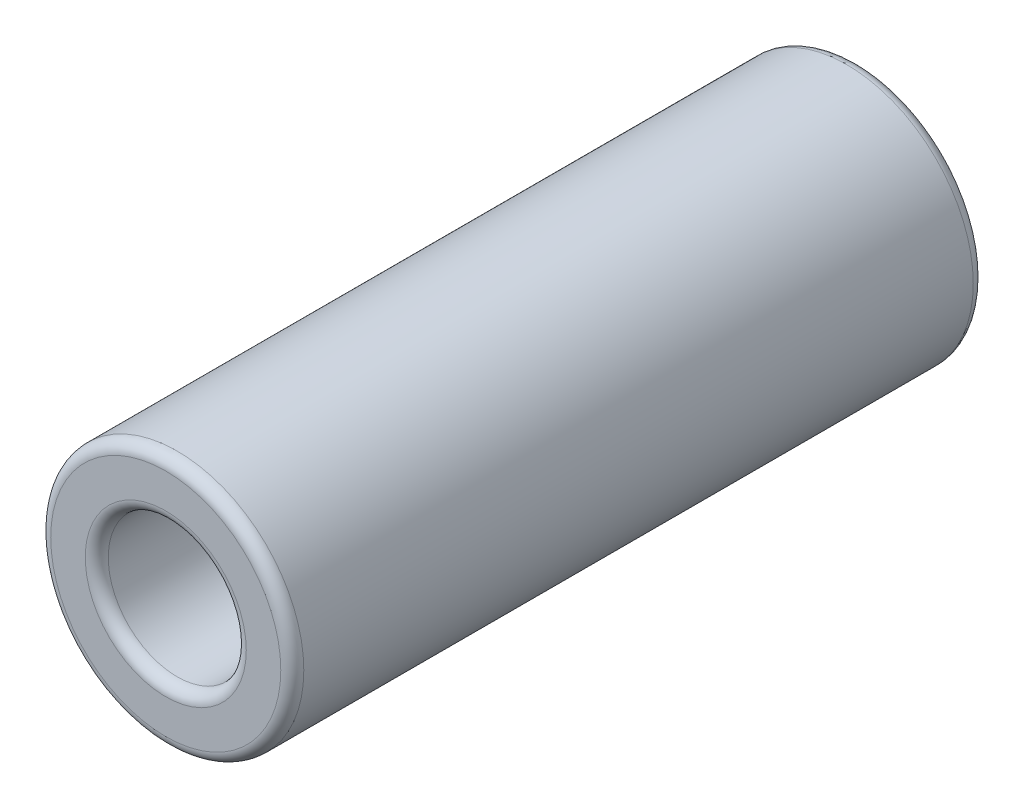
ISO-10303-21;
HEADER;
FILE_DESCRIPTION(('STEP AP214'),'2;1');
FILE_NAME('part.step','',(''),(''),'','','');
FILE_SCHEMA(('AUTOMOTIVE_DESIGN { 1 0 10303 214 1 1 1 1 }'));
ENDSEC;
DATA;
#1=APPLICATION_CONTEXT('core data for automotive mechanical design processes');
#2=APPLICATION_PROTOCOL_DEFINITION('international standard','automotive_design',2000,#1);
#3=PRODUCT_CONTEXT('',#1,'mechanical');
#4=PRODUCT('Part','Part','',(#3));
#5=PRODUCT_RELATED_PRODUCT_CATEGORY('part','',(#4));
#6=PRODUCT_DEFINITION_FORMATION('','',#4);
#7=PRODUCT_DEFINITION_CONTEXT('part definition',#1,'design');
#8=PRODUCT_DEFINITION('design','',#6,#7);
#9=PRODUCT_DEFINITION_SHAPE('','',#8);
#10=(LENGTH_UNIT() NAMED_UNIT(*) SI_UNIT(.MILLI.,.METRE.));
#11=(NAMED_UNIT(*) PLANE_ANGLE_UNIT() SI_UNIT($,.RADIAN.));
#12=(NAMED_UNIT(*) SI_UNIT($,.STERADIAN.) SOLID_ANGLE_UNIT());
#13=UNCERTAINTY_MEASURE_WITH_UNIT(LENGTH_MEASURE(1.E-05),#10,'distance_accuracy_value','');
#14=(GEOMETRIC_REPRESENTATION_CONTEXT(3) GLOBAL_UNCERTAINTY_ASSIGNED_CONTEXT((#13)) GLOBAL_UNIT_ASSIGNED_CONTEXT((#10,
#11,#12)) REPRESENTATION_CONTEXT('',''));
#15=CARTESIAN_POINT('',(0.,0.,0.));
#16=DIRECTION('',(0.,0.,1.));
#17=DIRECTION('',(1.,0.,0.));
#18=AXIS2_PLACEMENT_3D('',#15,#16,#17);
#19=CARTESIAN_POINT('',(0.,0.,30.1));
#20=DIRECTION('',(0.,0.,-1.));
#21=DIRECTION('',(-1.,0.,0.));
#22=AXIS2_PLACEMENT_3D('',#19,#20,#21);
#23=CYLINDRICAL_SURFACE('',#22,5.5);
#24=CARTESIAN_POINT('',(0.,0.,0.5));
#25=DIRECTION('',(0.,0.,1.));
#26=DIRECTION('',(1.,0.,0.));
#27=AXIS2_PLACEMENT_3D('',#24,#25,#26);
#28=CIRCLE('',#27,5.5);
#29=CARTESIAN_POINT('',(5.5,0.,0.500000000000001));
#30=VERTEX_POINT('',#29);
#31=EDGE_CURVE('E72',#30,#30,#28,.T.);
#32=ORIENTED_EDGE('',*,*,#31,.T.);
#33=EDGE_LOOP('',(#32));
#34=FACE_BOUND('',#33,.T.);
#35=CARTESIAN_POINT('',(0.,0.,29.6));
#36=DIRECTION('',(0.,0.,1.));
#37=DIRECTION('',(1.,0.,0.));
#38=AXIS2_PLACEMENT_3D('',#35,#36,#37);
#39=CIRCLE('',#38,5.5);
#40=CARTESIAN_POINT('',(5.5,0.,29.6));
#41=VERTEX_POINT('',#40);
#42=EDGE_CURVE('E75',#41,#41,#39,.F.);
#43=ORIENTED_EDGE('',*,*,#42,.T.);
#44=EDGE_LOOP('',(#43));
#45=FACE_BOUND('',#44,.T.);
#46=ADVANCED_FACE('F46',(#34,#45),#23,.T.);
#47=CARTESIAN_POINT('',(0.,0.,30.1));
#48=DIRECTION('',(0.,0.,1.));
#49=DIRECTION('',(1.,0.,0.));
#50=AXIS2_PLACEMENT_3D('',#47,#48,#49);
#51=PLANE('',#50);
#52=CARTESIAN_POINT('',(0.,0.,30.1));
#53=DIRECTION('',(0.,0.,1.));
#54=DIRECTION('',(1.,0.,0.));
#55=AXIS2_PLACEMENT_3D('',#52,#53,#54);
#56=CIRCLE('',#55,5.);
#57=CARTESIAN_POINT('',(5.,0.,30.1));
#58=VERTEX_POINT('',#57);
#59=EDGE_CURVE('E12',#58,#58,#56,.T.);
#60=ORIENTED_EDGE('',*,*,#59,.T.);
#61=EDGE_LOOP('',(#60));
#62=FACE_BOUND('',#61,.T.);
#63=CARTESIAN_POINT('',(0.,0.,30.1));
#64=DIRECTION('',(0.,0.,1.));
#65=DIRECTION('',(1.,0.,0.));
#66=AXIS2_PLACEMENT_3D('',#63,#64,#65);
#67=CIRCLE('',#66,3.5);
#68=CARTESIAN_POINT('',(3.5,0.,30.1));
#69=VERTEX_POINT('',#68);
#70=EDGE_CURVE('E53',#69,#69,#67,.F.);
#71=ORIENTED_EDGE('',*,*,#70,.T.);
#72=EDGE_LOOP('',(#71));
#73=FACE_BOUND('',#72,.T.);
#74=ADVANCED_FACE('F93',(#62,#73),#51,.T.);
#75=CARTESIAN_POINT('',(0.,0.,0.));
#76=DIRECTION('',(0.,0.,1.));
#77=DIRECTION('',(1.,0.,0.));
#78=AXIS2_PLACEMENT_3D('',#75,#76,#77);
#79=PLANE('',#78);
#80=CARTESIAN_POINT('',(0.,0.,0.));
#81=DIRECTION('',(0.,0.,1.));
#82=DIRECTION('',(1.,0.,0.));
#83=AXIS2_PLACEMENT_3D('',#80,#81,#82);
#84=CIRCLE('',#83,5.);
#85=CARTESIAN_POINT('',(5.,0.,0.));
#86=VERTEX_POINT('',#85);
#87=EDGE_CURVE('E66',#86,#86,#84,.F.);
#88=ORIENTED_EDGE('',*,*,#87,.T.);
#89=EDGE_LOOP('',(#88));
#90=FACE_BOUND('',#89,.T.);
#91=CARTESIAN_POINT('',(0.,0.,0.));
#92=DIRECTION('',(0.,0.,1.));
#93=DIRECTION('',(1.,0.,0.));
#94=AXIS2_PLACEMENT_3D('',#91,#92,#93);
#95=CIRCLE('',#94,3.5);
#96=CARTESIAN_POINT('',(3.5,0.,0.));
#97=VERTEX_POINT('',#96);
#98=EDGE_CURVE('E69',#97,#97,#95,.T.);
#99=ORIENTED_EDGE('',*,*,#98,.T.);
#100=EDGE_LOOP('',(#99));
#101=FACE_BOUND('',#100,.T.);
#102=ADVANCED_FACE('F99',(#90,#101),#79,.F.);
#103=CARTESIAN_POINT('',(0.,0.,0.));
#104=DIRECTION('',(0.,0.,1.));
#105=DIRECTION('',(1.,0.,0.));
#106=AXIS2_PLACEMENT_3D('',#103,#104,#105);
#107=CYLINDRICAL_SURFACE('',#106,3.);
#108=CARTESIAN_POINT('',(0.,0.,0.5));
#109=DIRECTION('',(0.,0.,1.));
#110=DIRECTION('',(1.,0.,0.));
#111=AXIS2_PLACEMENT_3D('',#108,#109,#110);
#112=CIRCLE('',#111,3.);
#113=CARTESIAN_POINT('',(3.,0.,0.500000000000001));
#114=VERTEX_POINT('',#113);
#115=EDGE_CURVE('E57',#114,#114,#112,.F.);
#116=ORIENTED_EDGE('',*,*,#115,.T.);
#117=EDGE_LOOP('',(#116));
#118=FACE_BOUND('',#117,.T.);
#119=CARTESIAN_POINT('',(0.,0.,29.6));
#120=DIRECTION('',(0.,0.,1.));
#121=DIRECTION('',(1.,0.,0.));
#122=AXIS2_PLACEMENT_3D('',#119,#120,#121);
#123=CIRCLE('',#122,3.);
#124=CARTESIAN_POINT('',(3.,0.,29.6));
#125=VERTEX_POINT('',#124);
#126=EDGE_CURVE('E61',#125,#125,#123,.T.);
#127=ORIENTED_EDGE('',*,*,#126,.T.);
#128=EDGE_LOOP('',(#127));
#129=FACE_BOUND('',#128,.T.);
#130=ADVANCED_FACE('F104',(#118,#129),#107,.F.);
#131=CARTESIAN_POINT('',(0.,0.,0.5));
#132=DIRECTION('',(0.,0.,1.));
#133=DIRECTION('',(1.,0.,0.));
#134=AXIS2_PLACEMENT_3D('',#131,#132,#133);
#135=TOROIDAL_SURFACE('',#134,5.,0.5);
#136=ORIENTED_EDGE('',*,*,#87,.F.);
#137=EDGE_LOOP('',(#136));
#138=FACE_BOUND('',#137,.T.);
#139=ORIENTED_EDGE('',*,*,#31,.F.);
#140=EDGE_LOOP('',(#139));
#141=FACE_BOUND('',#140,.T.);
#142=ADVANCED_FACE('F89',(#138,#141),#135,.T.);
#143=CARTESIAN_POINT('',(0.,0.,0.5));
#144=DIRECTION('',(0.,0.,1.));
#145=DIRECTION('',(1.,0.,0.));
#146=AXIS2_PLACEMENT_3D('',#143,#144,#145);
#147=TOROIDAL_SURFACE('',#146,3.5,0.5);
#148=ORIENTED_EDGE('',*,*,#115,.F.);
#149=EDGE_LOOP('',(#148));
#150=FACE_BOUND('',#149,.T.);
#151=ORIENTED_EDGE('',*,*,#98,.F.);
#152=EDGE_LOOP('',(#151));
#153=FACE_BOUND('',#152,.T.);
#154=ADVANCED_FACE('F83',(#150,#153),#147,.T.);
#155=CARTESIAN_POINT('',(0.,0.,29.6));
#156=DIRECTION('',(0.,0.,1.));
#157=DIRECTION('',(1.,0.,0.));
#158=AXIS2_PLACEMENT_3D('',#155,#156,#157);
#159=TOROIDAL_SURFACE('',#158,5.,0.5);
#160=ORIENTED_EDGE('',*,*,#42,.F.);
#161=EDGE_LOOP('',(#160));
#162=FACE_BOUND('',#161,.T.);
#163=ORIENTED_EDGE('',*,*,#59,.F.);
#164=EDGE_LOOP('',(#163));
#165=FACE_BOUND('',#164,.T.);
#166=ADVANCED_FACE('F80',(#162,#165),#159,.T.);
#167=CARTESIAN_POINT('',(0.,0.,29.6));
#168=DIRECTION('',(0.,0.,1.));
#169=DIRECTION('',(1.,0.,0.));
#170=AXIS2_PLACEMENT_3D('',#167,#168,#169);
#171=TOROIDAL_SURFACE('',#170,3.5,0.5);
#172=ORIENTED_EDGE('',*,*,#70,.F.);
#173=EDGE_LOOP('',(#172));
#174=FACE_BOUND('',#173,.T.);
#175=ORIENTED_EDGE('',*,*,#126,.F.);
#176=EDGE_LOOP('',(#175));
#177=FACE_BOUND('',#176,.T.);
#178=ADVANCED_FACE('F48',(#174,#177),#171,.T.);
#179=CLOSED_SHELL('',(#46,#74,#102,#130,#142,#154,#166,#178));
#180=MANIFOLD_SOLID_BREP('B2',#179);
#181=ADVANCED_BREP_SHAPE_REPRESENTATION('',(#18,#180),#14);
#182=SHAPE_DEFINITION_REPRESENTATION(#9,#181);
ENDSEC;
END-ISO-10303-21;
